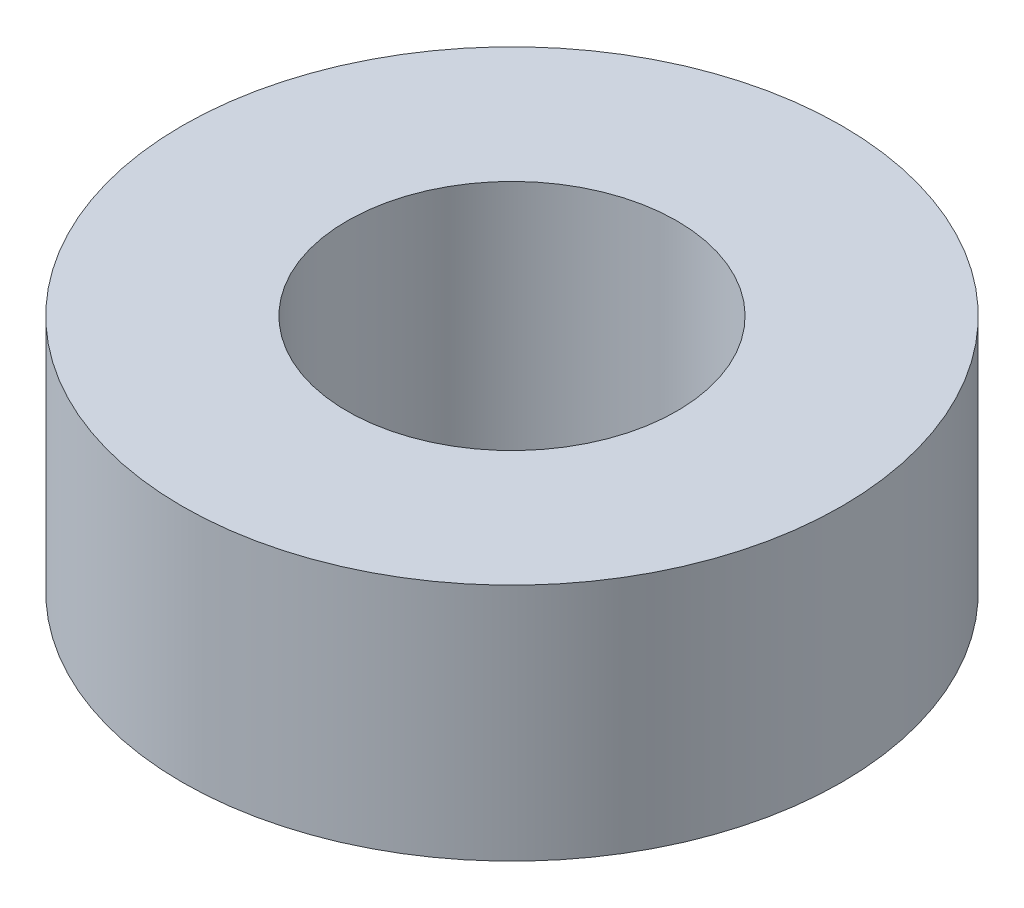
ISO-10303-21;
HEADER;
FILE_DESCRIPTION(('STEP AP214'),'2;1');
FILE_NAME('part.step','',(''),(''),'','','');
FILE_SCHEMA(('AUTOMOTIVE_DESIGN { 1 0 10303 214 1 1 1 1 }'));
ENDSEC;
DATA;
#1=APPLICATION_CONTEXT('core data for automotive mechanical design processes');
#2=APPLICATION_PROTOCOL_DEFINITION('international standard','automotive_design',2000,#1);
#3=PRODUCT_CONTEXT('',#1,'mechanical');
#4=PRODUCT('Part','Part','',(#3));
#5=PRODUCT_RELATED_PRODUCT_CATEGORY('part','',(#4));
#6=PRODUCT_DEFINITION_FORMATION('','',#4);
#7=PRODUCT_DEFINITION_CONTEXT('part definition',#1,'design');
#8=PRODUCT_DEFINITION('design','',#6,#7);
#9=PRODUCT_DEFINITION_SHAPE('','',#8);
#10=(LENGTH_UNIT() NAMED_UNIT(*) SI_UNIT(.MILLI.,.METRE.));
#11=(NAMED_UNIT(*) PLANE_ANGLE_UNIT() SI_UNIT($,.RADIAN.));
#12=(NAMED_UNIT(*) SI_UNIT($,.STERADIAN.) SOLID_ANGLE_UNIT());
#13=UNCERTAINTY_MEASURE_WITH_UNIT(LENGTH_MEASURE(1.E-05),#10,'distance_accuracy_value','');
#14=(GEOMETRIC_REPRESENTATION_CONTEXT(3) GLOBAL_UNCERTAINTY_ASSIGNED_CONTEXT((#13)) GLOBAL_UNIT_ASSIGNED_CONTEXT((#10,
#11,#12)) REPRESENTATION_CONTEXT('',''));
#15=CARTESIAN_POINT('',(0.,0.,0.));
#16=DIRECTION('',(0.,0.,1.));
#17=DIRECTION('',(1.,0.,0.));
#18=AXIS2_PLACEMENT_3D('',#15,#16,#17);
#19=CARTESIAN_POINT('',(0.,29.,0.));
#20=DIRECTION('',(0.,-1.,0.));
#21=DIRECTION('',(0.,0.,-1.));
#22=AXIS2_PLACEMENT_3D('',#19,#20,#21);
#23=CYLINDRICAL_SURFACE('',#22,40.);
#24=CARTESIAN_POINT('',(0.,29.,0.));
#25=DIRECTION('',(0.,1.,0.));
#26=DIRECTION('',(0.,0.,1.));
#27=AXIS2_PLACEMENT_3D('',#24,#25,#26);
#28=CIRCLE('',#27,40.);
#29=CARTESIAN_POINT('',(0.,29.,-40.));
#30=VERTEX_POINT('',#29);
#31=EDGE_CURVE('E10',#30,#30,#28,.T.);
#32=CARTESIAN_POINT('',(0.,0.,0.));
#33=DIRECTION('',(0.,1.,0.));
#34=DIRECTION('',(0.,0.,1.));
#35=AXIS2_PLACEMENT_3D('',#32,#33,#34);
#36=CIRCLE('',#35,40.);
#37=CARTESIAN_POINT('',(0.,0.,-40.));
#38=VERTEX_POINT('',#37);
#39=EDGE_CURVE('E37',#38,#38,#36,.T.);
#40=CARTESIAN_POINT('',(0.,29.,-40.));
#41=CARTESIAN_POINT('',(0.,28.6979166666667,-40.));
#42=CARTESIAN_POINT('',(0.,28.3958333333333,-40.));
#43=CARTESIAN_POINT('',(0.,27.7916666666667,-40.));
#44=CARTESIAN_POINT('',(0.,27.4895833333333,-40.));
#45=CARTESIAN_POINT('',(0.,26.8854166666667,-40.));
#46=CARTESIAN_POINT('',(0.,26.5833333333333,-40.));
#47=CARTESIAN_POINT('',(0.,25.9791666666667,-40.));
#48=CARTESIAN_POINT('',(0.,25.6770833333333,-40.));
#49=CARTESIAN_POINT('',(0.,25.0729166666667,-40.));
#50=CARTESIAN_POINT('',(0.,24.7708333333333,-40.));
#51=CARTESIAN_POINT('',(0.,24.1666666666667,-40.));
#52=CARTESIAN_POINT('',(0.,23.8645833333333,-40.));
#53=CARTESIAN_POINT('',(0.,23.2604166666667,-40.));
#54=CARTESIAN_POINT('',(0.,22.9583333333333,-40.));
#55=CARTESIAN_POINT('',(0.,22.3541666666667,-40.));
#56=CARTESIAN_POINT('',(0.,22.0520833333333,-40.));
#57=CARTESIAN_POINT('',(0.,21.4479166666667,-40.));
#58=CARTESIAN_POINT('',(0.,21.1458333333333,-40.));
#59=CARTESIAN_POINT('',(0.,20.5416666666667,-40.));
#60=CARTESIAN_POINT('',(0.,20.2395833333333,-40.));
#61=CARTESIAN_POINT('',(0.,19.6354166666667,-40.));
#62=CARTESIAN_POINT('',(0.,19.3333333333333,-40.));
#63=CARTESIAN_POINT('',(0.,18.7291666666667,-40.));
#64=CARTESIAN_POINT('',(0.,18.4270833333333,-40.));
#65=CARTESIAN_POINT('',(0.,17.8229166666667,-40.));
#66=CARTESIAN_POINT('',(0.,17.5208333333333,-40.));
#67=CARTESIAN_POINT('',(0.,16.9166666666667,-40.));
#68=CARTESIAN_POINT('',(0.,16.6145833333333,-40.));
#69=CARTESIAN_POINT('',(0.,16.0104166666667,-40.));
#70=CARTESIAN_POINT('',(0.,15.7083333333333,-40.));
#71=CARTESIAN_POINT('',(0.,15.1041666666667,-40.));
#72=CARTESIAN_POINT('',(0.,14.8020833333333,-40.));
#73=CARTESIAN_POINT('',(0.,14.1979166666667,-40.));
#74=CARTESIAN_POINT('',(0.,13.8958333333333,-40.));
#75=CARTESIAN_POINT('',(0.,13.2916666666667,-40.));
#76=CARTESIAN_POINT('',(0.,12.9895833333333,-40.));
#77=CARTESIAN_POINT('',(0.,12.3854166666667,-40.));
#78=CARTESIAN_POINT('',(0.,12.0833333333333,-40.));
#79=CARTESIAN_POINT('',(0.,11.4791666666667,-40.));
#80=CARTESIAN_POINT('',(0.,11.1770833333333,-40.));
#81=CARTESIAN_POINT('',(0.,10.5729166666667,-40.));
#82=CARTESIAN_POINT('',(0.,10.2708333333333,-40.));
#83=CARTESIAN_POINT('',(0.,9.66666666666667,-40.));
#84=CARTESIAN_POINT('',(0.,9.36458333333333,-40.));
#85=CARTESIAN_POINT('',(0.,8.76041666666667,-40.));
#86=CARTESIAN_POINT('',(0.,8.45833333333333,-40.));
#87=CARTESIAN_POINT('',(0.,7.85416666666667,-40.));
#88=CARTESIAN_POINT('',(0.,7.55208333333333,-40.));
#89=CARTESIAN_POINT('',(0.,6.94791666666667,-40.));
#90=CARTESIAN_POINT('',(0.,6.64583333333333,-40.));
#91=CARTESIAN_POINT('',(0.,6.04166666666667,-40.));
#92=CARTESIAN_POINT('',(0.,5.73958333333333,-40.));
#93=CARTESIAN_POINT('',(0.,5.13541666666667,-40.));
#94=CARTESIAN_POINT('',(0.,4.83333333333333,-40.));
#95=CARTESIAN_POINT('',(0.,4.22916666666667,-40.));
#96=CARTESIAN_POINT('',(0.,3.92708333333333,-40.));
#97=CARTESIAN_POINT('',(0.,3.32291666666667,-40.));
#98=CARTESIAN_POINT('',(0.,3.02083333333333,-40.));
#99=CARTESIAN_POINT('',(0.,2.41666666666667,-40.));
#100=CARTESIAN_POINT('',(0.,2.11458333333333,-40.));
#101=CARTESIAN_POINT('',(0.,1.51041666666667,-40.));
#102=CARTESIAN_POINT('',(0.,1.20833333333333,-40.));
#103=CARTESIAN_POINT('',(0.,0.604166666666667,-40.));
#104=CARTESIAN_POINT('',(0.,0.302083333333333,-40.));
#105=CARTESIAN_POINT('',(0.,0.,-40.));
#106=B_SPLINE_CURVE_WITH_KNOTS('',3,(#40,#41,#42,#43,#44,#45,#46,#47,#48,#49,#50,#51,#52,#53,
#54,#55,#56,#57,#58,#59,#60,#61,#62,#63,#64,#65,#66,#67,#68,#69,#70,#71,#72,#73,#74,#75,#76,#77,
#78,#79,#80,#81,#82,#83,#84,#85,#86,#87,#88,#89,#90,#91,#92,#93,#94,#95,#96,#97,#98,#99,#100,
#101,#102,#103,#104,#105),.UNSPECIFIED.,.F.,.F.,(4,2,2,2,2,2,2,2,2,2,2,2,2,2,2,2,2,2,2,2,2,2,2,
2,2,2,2,2,2,2,2,2,4),(0.,0.906249999999997,1.8125,2.71875,3.625,4.53125,5.4375,6.34375,7.25,
8.15625,9.0625,9.96875,10.875,11.78125,12.6875,13.59375,14.5,15.40625,16.3125,17.21875,18.125,
19.03125,19.9375,20.84375,21.75,22.65625,23.5625,24.46875,25.375,26.28125,27.1875,28.09375,29.),.UNSPECIFIED.);
#107=EDGE_CURVE('BSEAM40',#30,#38,#106,.T.);
#108=ORIENTED_EDGE('',*,*,#31,.F.);
#109=ORIENTED_EDGE('',*,*,#39,.T.);
#110=ORIENTED_EDGE('',*,*,#107,.T.);
#111=ORIENTED_EDGE('',*,*,#107,.F.);
#112=EDGE_LOOP('',(#108,#110,#109,#111));
#113=FACE_BOUND('',#112,.T.);
#114=ADVANCED_FACE('F40',(#113),#23,.T.);
#115=CARTESIAN_POINT('',(0.,29.,0.));
#116=DIRECTION('',(0.,1.,0.));
#117=DIRECTION('',(0.,0.,1.));
#118=AXIS2_PLACEMENT_3D('',#115,#116,#117);
#119=PLANE('',#118);
#120=CARTESIAN_POINT('',(0.,29.,0.));
#121=DIRECTION('',(0.,1.,0.));
#122=DIRECTION('',(0.,0.,1.));
#123=AXIS2_PLACEMENT_3D('',#120,#121,#122);
#124=CIRCLE('',#123,20.);
#125=CARTESIAN_POINT('',(0.,29.,-20.));
#126=VERTEX_POINT('',#125);
#127=EDGE_CURVE('E50',#126,#126,#124,.T.);
#128=ORIENTED_EDGE('',*,*,#127,.F.);
#129=EDGE_LOOP('',(#128));
#130=FACE_BOUND('',#129,.T.);
#131=ORIENTED_EDGE('',*,*,#31,.T.);
#132=EDGE_LOOP('',(#131));
#133=FACE_BOUND('',#132,.T.);
#134=ADVANCED_FACE('F59',(#130,#133),#119,.T.);
#135=CARTESIAN_POINT('',(0.,0.,0.));
#136=DIRECTION('',(0.,1.,0.));
#137=DIRECTION('',(0.,0.,1.));
#138=AXIS2_PLACEMENT_3D('',#135,#136,#137);
#139=PLANE('',#138);
#140=CARTESIAN_POINT('',(0.,0.,0.));
#141=DIRECTION('',(0.,1.,0.));
#142=DIRECTION('',(0.,0.,1.));
#143=AXIS2_PLACEMENT_3D('',#140,#141,#142);
#144=CIRCLE('',#143,20.);
#145=CARTESIAN_POINT('',(0.,0.,-20.));
#146=VERTEX_POINT('',#145);
#147=EDGE_CURVE('E47',#146,#146,#144,.T.);
#148=ORIENTED_EDGE('',*,*,#147,.T.);
#149=EDGE_LOOP('',(#148));
#150=FACE_BOUND('',#149,.T.);
#151=ORIENTED_EDGE('',*,*,#39,.F.);
#152=EDGE_LOOP('',(#151));
#153=FACE_BOUND('',#152,.T.);
#154=ADVANCED_FACE('F58',(#150,#153),#139,.F.);
#155=CARTESIAN_POINT('',(0.,29.,0.));
#156=DIRECTION('',(0.,-1.,0.));
#157=DIRECTION('',(0.,0.,-1.));
#158=AXIS2_PLACEMENT_3D('',#155,#156,#157);
#159=CYLINDRICAL_SURFACE('',#158,20.);
#160=CARTESIAN_POINT('',(0.,29.,-20.));
#161=CARTESIAN_POINT('',(0.,28.6979166666667,-20.));
#162=CARTESIAN_POINT('',(0.,28.3958333333333,-20.));
#163=CARTESIAN_POINT('',(0.,27.7916666666667,-20.));
#164=CARTESIAN_POINT('',(0.,27.4895833333333,-20.));
#165=CARTESIAN_POINT('',(0.,26.8854166666667,-20.));
#166=CARTESIAN_POINT('',(0.,26.5833333333333,-20.));
#167=CARTESIAN_POINT('',(0.,25.9791666666667,-20.));
#168=CARTESIAN_POINT('',(0.,25.6770833333333,-20.));
#169=CARTESIAN_POINT('',(0.,25.0729166666667,-20.));
#170=CARTESIAN_POINT('',(0.,24.7708333333333,-20.));
#171=CARTESIAN_POINT('',(0.,24.1666666666667,-20.));
#172=CARTESIAN_POINT('',(0.,23.8645833333333,-20.));
#173=CARTESIAN_POINT('',(0.,23.2604166666667,-20.));
#174=CARTESIAN_POINT('',(0.,22.9583333333333,-20.));
#175=CARTESIAN_POINT('',(0.,22.3541666666667,-20.));
#176=CARTESIAN_POINT('',(0.,22.0520833333333,-20.));
#177=CARTESIAN_POINT('',(0.,21.4479166666667,-20.));
#178=CARTESIAN_POINT('',(0.,21.1458333333333,-20.));
#179=CARTESIAN_POINT('',(0.,20.5416666666667,-20.));
#180=CARTESIAN_POINT('',(0.,20.2395833333333,-20.));
#181=CARTESIAN_POINT('',(0.,19.6354166666667,-20.));
#182=CARTESIAN_POINT('',(0.,19.3333333333333,-20.));
#183=CARTESIAN_POINT('',(0.,18.7291666666667,-20.));
#184=CARTESIAN_POINT('',(0.,18.4270833333333,-20.));
#185=CARTESIAN_POINT('',(0.,17.8229166666667,-20.));
#186=CARTESIAN_POINT('',(0.,17.5208333333333,-20.));
#187=CARTESIAN_POINT('',(0.,16.9166666666667,-20.));
#188=CARTESIAN_POINT('',(0.,16.6145833333333,-20.));
#189=CARTESIAN_POINT('',(0.,16.0104166666667,-20.));
#190=CARTESIAN_POINT('',(0.,15.7083333333333,-20.));
#191=CARTESIAN_POINT('',(0.,15.1041666666667,-20.));
#192=CARTESIAN_POINT('',(0.,14.8020833333333,-20.));
#193=CARTESIAN_POINT('',(0.,14.1979166666667,-20.));
#194=CARTESIAN_POINT('',(0.,13.8958333333333,-20.));
#195=CARTESIAN_POINT('',(0.,13.2916666666667,-20.));
#196=CARTESIAN_POINT('',(0.,12.9895833333333,-20.));
#197=CARTESIAN_POINT('',(0.,12.3854166666667,-20.));
#198=CARTESIAN_POINT('',(0.,12.0833333333333,-20.));
#199=CARTESIAN_POINT('',(0.,11.4791666666667,-20.));
#200=CARTESIAN_POINT('',(0.,11.1770833333333,-20.));
#201=CARTESIAN_POINT('',(0.,10.5729166666667,-20.));
#202=CARTESIAN_POINT('',(0.,10.2708333333333,-20.));
#203=CARTESIAN_POINT('',(0.,9.66666666666667,-20.));
#204=CARTESIAN_POINT('',(0.,9.36458333333333,-20.));
#205=CARTESIAN_POINT('',(0.,8.76041666666667,-20.));
#206=CARTESIAN_POINT('',(0.,8.45833333333333,-20.));
#207=CARTESIAN_POINT('',(0.,7.85416666666667,-20.));
#208=CARTESIAN_POINT('',(0.,7.55208333333333,-20.));
#209=CARTESIAN_POINT('',(0.,6.94791666666667,-20.));
#210=CARTESIAN_POINT('',(0.,6.64583333333333,-20.));
#211=CARTESIAN_POINT('',(0.,6.04166666666667,-20.));
#212=CARTESIAN_POINT('',(0.,5.73958333333333,-20.));
#213=CARTESIAN_POINT('',(0.,5.13541666666667,-20.));
#214=CARTESIAN_POINT('',(0.,4.83333333333333,-20.));
#215=CARTESIAN_POINT('',(0.,4.22916666666667,-20.));
#216=CARTESIAN_POINT('',(0.,3.92708333333333,-20.));
#217=CARTESIAN_POINT('',(0.,3.32291666666667,-20.));
#218=CARTESIAN_POINT('',(0.,3.02083333333333,-20.));
#219=CARTESIAN_POINT('',(0.,2.41666666666667,-20.));
#220=CARTESIAN_POINT('',(0.,2.11458333333333,-20.));
#221=CARTESIAN_POINT('',(0.,1.51041666666667,-20.));
#222=CARTESIAN_POINT('',(0.,1.20833333333333,-20.));
#223=CARTESIAN_POINT('',(0.,0.604166666666667,-20.));
#224=CARTESIAN_POINT('',(0.,0.302083333333333,-20.));
#225=CARTESIAN_POINT('',(0.,0.,-20.));
#226=B_SPLINE_CURVE_WITH_KNOTS('',3,(#160,#161,#162,#163,#164,#165,#166,#167,#168,#169,#170,
#171,#172,#173,#174,#175,#176,#177,#178,#179,#180,#181,#182,#183,#184,#185,#186,#187,#188,#189,
#190,#191,#192,#193,#194,#195,#196,#197,#198,#199,#200,#201,#202,#203,#204,#205,#206,#207,#208,
#209,#210,#211,#212,#213,#214,#215,#216,#217,#218,#219,#220,#221,#222,#223,#224,#225),
.UNSPECIFIED.,.F.,.F.,(4,2,2,2,2,2,2,2,2,2,2,2,2,2,2,2,2,2,2,2,2,2,2,2,2,2,2,2,2,2,2,2,4),(0.,
0.906249999999997,1.8125,2.71875,3.625,4.53125,5.4375,6.34375,7.25,8.15625,9.0625,9.96875,
10.875,11.78125,12.6875,13.59375,14.5,15.40625,16.3125,17.21875,18.125,19.03125,19.9375,
20.84375,21.75,22.65625,23.5625,24.46875,25.375,26.28125,27.1875,28.09375,29.),.UNSPECIFIED.);
#227=EDGE_CURVE('BSEAM54',#126,#146,#226,.T.);
#228=ORIENTED_EDGE('',*,*,#127,.T.);
#229=ORIENTED_EDGE('',*,*,#147,.F.);
#230=ORIENTED_EDGE('',*,*,#227,.T.);
#231=ORIENTED_EDGE('',*,*,#227,.F.);
#232=EDGE_LOOP('',(#228,#230,#229,#231));
#233=FACE_BOUND('',#232,.T.);
#234=ADVANCED_FACE('F54',(#233),#159,.F.);
#235=CLOSED_SHELL('',(#114,#134,#154,#234));
#236=MANIFOLD_SOLID_BREP('B2',#235);
#237=ADVANCED_BREP_SHAPE_REPRESENTATION('',(#18,#236),#14);
#238=SHAPE_DEFINITION_REPRESENTATION(#9,#237);
ENDSEC;
END-ISO-10303-21;
